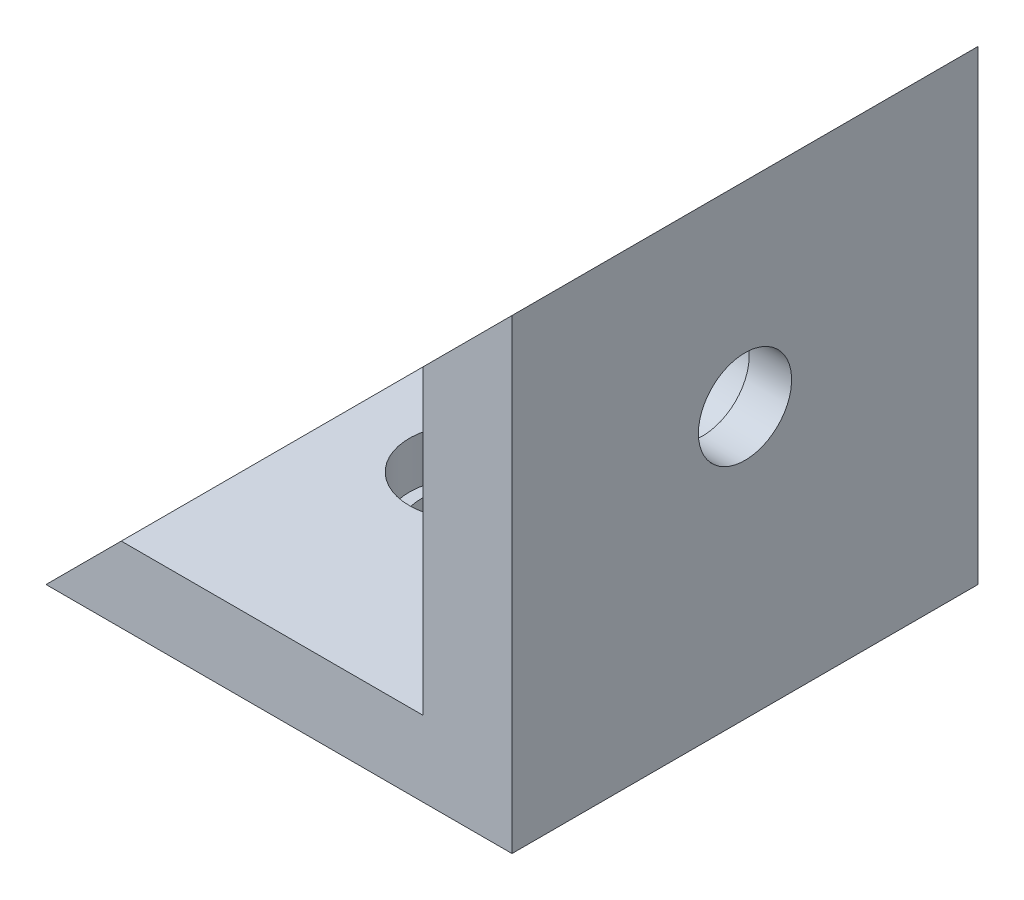
ISO-10303-21;
HEADER;
FILE_DESCRIPTION(('STEP AP214'),'2;1');
FILE_NAME('part.step','',(''),(''),'','','');
FILE_SCHEMA(('AUTOMOTIVE_DESIGN { 1 0 10303 214 1 1 1 1 }'));
ENDSEC;
DATA;
#1=APPLICATION_CONTEXT('core data for automotive mechanical design processes');
#2=APPLICATION_PROTOCOL_DEFINITION('international standard','automotive_design',2000,#1);
#3=PRODUCT_CONTEXT('',#1,'mechanical');
#4=PRODUCT('Part','Part','',(#3));
#5=PRODUCT_RELATED_PRODUCT_CATEGORY('part','',(#4));
#6=PRODUCT_DEFINITION_FORMATION('','',#4);
#7=PRODUCT_DEFINITION_CONTEXT('part definition',#1,'design');
#8=PRODUCT_DEFINITION('design','',#6,#7);
#9=PRODUCT_DEFINITION_SHAPE('','',#8);
#10=(LENGTH_UNIT() NAMED_UNIT(*) SI_UNIT(.MILLI.,.METRE.));
#11=(NAMED_UNIT(*) PLANE_ANGLE_UNIT() SI_UNIT($,.RADIAN.));
#12=(NAMED_UNIT(*) SI_UNIT($,.STERADIAN.) SOLID_ANGLE_UNIT());
#13=UNCERTAINTY_MEASURE_WITH_UNIT(LENGTH_MEASURE(1.E-05),#10,'distance_accuracy_value','');
#14=(GEOMETRIC_REPRESENTATION_CONTEXT(3) GLOBAL_UNCERTAINTY_ASSIGNED_CONTEXT((#13)) GLOBAL_UNIT_ASSIGNED_CONTEXT((#10,
#11,#12)) REPRESENTATION_CONTEXT('',''));
#15=CARTESIAN_POINT('',(0.,0.,0.));
#16=DIRECTION('',(0.,0.,1.));
#17=DIRECTION('',(1.,0.,0.));
#18=AXIS2_PLACEMENT_3D('',#15,#16,#17);
#19=CARTESIAN_POINT('',(-15.0810609763986,-22.3919909087651,10.));
#20=DIRECTION('',(0.,1.,0.));
#21=DIRECTION('',(0.,0.,1.));
#22=AXIS2_PLACEMENT_3D('',#19,#20,#21);
#23=CYLINDRICAL_SURFACE('',#22,2.);
#24=CARTESIAN_POINT('',(-15.0810609763986,-15.6220829740347,10.));
#25=DIRECTION('',(0.,1.,0.));
#26=DIRECTION('',(0.,0.,1.));
#27=AXIS2_PLACEMENT_3D('',#24,#25,#26);
#28=CIRCLE('',#27,2.);
#29=CARTESIAN_POINT('',(-15.0810609763986,-15.6220829740347,12.));
#30=VERTEX_POINT('',#29);
#31=EDGE_CURVE('E185',#30,#30,#28,.T.);
#32=ORIENTED_EDGE('',*,*,#31,.F.);
#33=EDGE_LOOP('',(#32));
#34=FACE_BOUND('',#33,.T.);
#35=CARTESIAN_POINT('',(-15.0810609763986,-14.3919909087651,10.));
#36=DIRECTION('',(0.,1.,0.));
#37=DIRECTION('',(0.,0.,1.));
#38=AXIS2_PLACEMENT_3D('',#35,#36,#37);
#39=CIRCLE('',#38,2.);
#40=CARTESIAN_POINT('',(-15.0810609763986,-14.3919909087651,12.));
#41=VERTEX_POINT('',#40);
#42=EDGE_CURVE('E51',#41,#41,#39,.F.);
#43=ORIENTED_EDGE('',*,*,#42,.F.);
#44=EDGE_LOOP('',(#43));
#45=FACE_BOUND('',#44,.T.);
#46=ADVANCED_FACE('F47',(#34,#45),#23,.F.);
#47=CARTESIAN_POINT('',(13.0106344586877,-4.00703694139992,10.));
#48=DIRECTION('',(-1.,0.,0.));
#49=DIRECTION('',(0.,0.,1.));
#50=AXIS2_PLACEMENT_3D('',#47,#48,#49);
#51=CYLINDRICAL_SURFACE('',#50,2.);
#52=CARTESIAN_POINT('',(-3.17275641148481,-4.00703694139992,10.));
#53=DIRECTION('',(-1.,0.,0.));
#54=DIRECTION('',(0.,0.,1.));
#55=AXIS2_PLACEMENT_3D('',#52,#53,#54);
#56=CIRCLE('',#55,2.);
#57=CARTESIAN_POINT('',(-3.17275641148481,-4.00703694139992,12.));
#58=VERTEX_POINT('',#57);
#59=EDGE_CURVE('E137',#58,#58,#56,.T.);
#60=ORIENTED_EDGE('',*,*,#59,.F.);
#61=EDGE_LOOP('',(#60));
#62=FACE_BOUND('',#61,.T.);
#63=CARTESIAN_POINT('',(-4.98936554131233,-4.00703694139992,10.));
#64=DIRECTION('',(-1.,0.,0.));
#65=DIRECTION('',(0.,0.,1.));
#66=AXIS2_PLACEMENT_3D('',#63,#64,#65);
#67=CIRCLE('',#66,2.);
#68=CARTESIAN_POINT('',(-4.98936554131233,-4.00703694139992,12.));
#69=VERTEX_POINT('',#68);
#70=EDGE_CURVE('E169',#69,#69,#67,.F.);
#71=ORIENTED_EDGE('',*,*,#70,.F.);
#72=EDGE_LOOP('',(#71));
#73=FACE_BOUND('',#72,.T.);
#74=ADVANCED_FACE('F206',(#62,#73),#51,.F.);
#75=CARTESIAN_POINT('',(-3.17275641148481,4.37791702596532,0.));
#76=DIRECTION('',(0.707106781186548,-0.707106781186548,0.));
#77=DIRECTION('',(0.707106781186548,0.707106781186548,0.));
#78=AXIS2_PLACEMENT_3D('',#75,#76,#77);
#79=PLANE('',#78);
#80=DIRECTION('',(0.,0.,1.));
#81=VECTOR('',#80,1.);
#82=CARTESIAN_POINT('',(-19.9426643462153,-12.3919909087651,0.));
#83=LINE('',#82,#81);
#84=CARTESIAN_POINT('',(-19.9426643462153,-12.3919909087651,0.));
#85=VERTEX_POINT('',#84);
#86=CARTESIAN_POINT('',(-19.9426643462153,-12.3919909087651,20.));
#87=VERTEX_POINT('',#86);
#88=EDGE_CURVE('E57',#85,#87,#83,.T.);
#89=ORIENTED_EDGE('',*,*,#88,.F.);
#90=DIRECTION('',(0.707106781186548,0.707106781186548,0.));
#91=VECTOR('',#90,1.);
#92=CARTESIAN_POINT('',(-3.17275641148481,4.37791702596532,0.));
#93=LINE('',#92,#91);
#94=CARTESIAN_POINT('',(-23.1727564114848,-15.6220829740347,0.));
#95=VERTEX_POINT('',#94);
#96=EDGE_CURVE('E95',#95,#85,#93,.T.);
#97=ORIENTED_EDGE('',*,*,#96,.F.);
#98=DIRECTION('',(0.,0.,-1.));
#99=VECTOR('',#98,1.);
#100=CARTESIAN_POINT('',(-23.1727564114848,-15.6220829740347,20.));
#101=LINE('',#100,#99);
#102=CARTESIAN_POINT('',(-23.1727564114848,-15.6220829740347,20.));
#103=VERTEX_POINT('',#102);
#104=EDGE_CURVE('E103',#103,#95,#101,.T.);
#105=ORIENTED_EDGE('',*,*,#104,.F.);
#106=DIRECTION('',(0.707106781186548,0.707106781186548,0.));
#107=VECTOR('',#106,1.);
#108=CARTESIAN_POINT('',(-3.17275641148481,4.37791702596532,20.));
#109=LINE('',#108,#107);
#110=EDGE_CURVE('E145',#103,#87,#109,.T.);
#111=ORIENTED_EDGE('',*,*,#110,.T.);
#112=EDGE_LOOP('',(#89,#97,#105,#111));
#113=FACE_BOUND('',#112,.T.);
#114=ADVANCED_FACE('F214',(#113),#79,.F.);
#115=CARTESIAN_POINT('',(-23.1727564114848,-15.6220829740347,20.));
#116=DIRECTION('',(0.,1.,0.));
#117=DIRECTION('',(0.,0.,1.));
#118=AXIS2_PLACEMENT_3D('',#115,#116,#117);
#119=PLANE('',#118);
#120=ORIENTED_EDGE('',*,*,#31,.T.);
#121=EDGE_LOOP('',(#120));
#122=FACE_BOUND('',#121,.T.);
#123=DIRECTION('',(1.,0.,0.));
#124=VECTOR('',#123,1.);
#125=CARTESIAN_POINT('',(-23.1727564114848,-15.6220829740347,0.));
#126=LINE('',#125,#124);
#127=CARTESIAN_POINT('',(-3.17275641148481,-15.6220829740347,0.));
#128=VERTEX_POINT('',#127);
#129=EDGE_CURVE('E151',#95,#128,#126,.T.);
#130=ORIENTED_EDGE('',*,*,#129,.T.);
#131=DIRECTION('',(0.,0.,-1.));
#132=VECTOR('',#131,1.);
#133=CARTESIAN_POINT('',(-3.17275641148481,-15.6220829740347,20.));
#134=LINE('',#133,#132);
#135=CARTESIAN_POINT('',(-3.17275641148481,-15.6220829740347,20.));
#136=VERTEX_POINT('',#135);
#137=EDGE_CURVE('E162',#136,#128,#134,.T.);
#138=ORIENTED_EDGE('',*,*,#137,.F.);
#139=DIRECTION('',(1.,0.,0.));
#140=VECTOR('',#139,1.);
#141=CARTESIAN_POINT('',(-23.1727564114848,-15.6220829740347,20.));
#142=LINE('',#141,#140);
#143=EDGE_CURVE('E74',#103,#136,#142,.T.);
#144=ORIENTED_EDGE('',*,*,#143,.F.);
#145=ORIENTED_EDGE('',*,*,#104,.T.);
#146=EDGE_LOOP('',(#130,#138,#144,#145));
#147=FACE_BOUND('',#146,.T.);
#148=ADVANCED_FACE('F242',(#122,#147),#119,.F.);
#149=CARTESIAN_POINT('',(-3.17275641148481,-15.6220829740347,20.));
#150=DIRECTION('',(-1.,0.,0.));
#151=DIRECTION('',(0.,0.,1.));
#152=AXIS2_PLACEMENT_3D('',#149,#150,#151);
#153=PLANE('',#152);
#154=ORIENTED_EDGE('',*,*,#59,.T.);
#155=EDGE_LOOP('',(#154));
#156=FACE_BOUND('',#155,.T.);
#157=DIRECTION('',(0.,1.,0.));
#158=VECTOR('',#157,1.);
#159=CARTESIAN_POINT('',(-3.17275641148481,-15.6220829740347,0.));
#160=LINE('',#159,#158);
#161=CARTESIAN_POINT('',(-3.17275641148481,4.37791702596532,0.));
#162=VERTEX_POINT('',#161);
#163=EDGE_CURVE('E144',#128,#162,#160,.T.);
#164=ORIENTED_EDGE('',*,*,#163,.T.);
#165=DIRECTION('',(0.,0.,-1.));
#166=VECTOR('',#165,1.);
#167=CARTESIAN_POINT('',(-3.17275641148481,4.37791702596532,20.));
#168=LINE('',#167,#166);
#169=CARTESIAN_POINT('',(-3.17275641148481,4.37791702596532,20.));
#170=VERTEX_POINT('',#169);
#171=EDGE_CURVE('E154',#170,#162,#168,.T.);
#172=ORIENTED_EDGE('',*,*,#171,.F.);
#173=DIRECTION('',(0.,1.,0.));
#174=VECTOR('',#173,1.);
#175=CARTESIAN_POINT('',(-3.17275641148481,-15.6220829740347,20.));
#176=LINE('',#175,#174);
#177=EDGE_CURVE('E148',#136,#170,#176,.T.);
#178=ORIENTED_EDGE('',*,*,#177,.F.);
#179=ORIENTED_EDGE('',*,*,#137,.T.);
#180=EDGE_LOOP('',(#164,#172,#178,#179));
#181=FACE_BOUND('',#180,.T.);
#182=ADVANCED_FACE('F49',(#156,#181),#153,.F.);
#183=CARTESIAN_POINT('',(0.,0.,20.));
#184=DIRECTION('',(0.,0.,1.));
#185=DIRECTION('',(1.,0.,0.));
#186=AXIS2_PLACEMENT_3D('',#183,#184,#185);
#187=PLANE('',#186);
#188=DIRECTION('',(0.,1.,0.));
#189=VECTOR('',#188,1.);
#190=CARTESIAN_POINT('',(-6.98936554131233,-12.3919909087651,20.));
#191=LINE('',#190,#189);
#192=CARTESIAN_POINT('',(-6.98936554131233,-12.3919909087651,20.));
#193=VERTEX_POINT('',#192);
#194=CARTESIAN_POINT('',(-6.98936554131233,0.561307896137794,20.));
#195=VERTEX_POINT('',#194);
#196=EDGE_CURVE('E112',#193,#195,#191,.T.);
#197=ORIENTED_EDGE('',*,*,#196,.F.);
#198=DIRECTION('',(-1.,0.,0.));
#199=VECTOR('',#198,1.);
#200=CARTESIAN_POINT('',(-6.98936554131233,-12.3919909087651,20.));
#201=LINE('',#200,#199);
#202=EDGE_CURVE('E122',#193,#87,#201,.T.);
#203=ORIENTED_EDGE('',*,*,#202,.T.);
#204=ORIENTED_EDGE('',*,*,#110,.F.);
#205=ORIENTED_EDGE('',*,*,#143,.T.);
#206=ORIENTED_EDGE('',*,*,#177,.T.);
#207=EDGE_CURVE('E124',#195,#170,#109,.T.);
#208=ORIENTED_EDGE('',*,*,#207,.F.);
#209=EDGE_LOOP('',(#197,#203,#204,#205,#206,#208));
#210=FACE_BOUND('',#209,.T.);
#211=ADVANCED_FACE('F238',(#210),#187,.T.);
#212=CARTESIAN_POINT('',(0.,0.,0.));
#213=DIRECTION('',(0.,0.,1.));
#214=DIRECTION('',(1.,0.,0.));
#215=AXIS2_PLACEMENT_3D('',#212,#213,#214);
#216=PLANE('',#215);
#217=DIRECTION('',(-1.,0.,0.));
#218=VECTOR('',#217,1.);
#219=CARTESIAN_POINT('',(-6.98936554131233,-12.3919909087651,0.));
#220=LINE('',#219,#218);
#221=CARTESIAN_POINT('',(-6.98936554131233,-12.3919909087651,0.));
#222=VERTEX_POINT('',#221);
#223=EDGE_CURVE('E65',#222,#85,#220,.T.);
#224=ORIENTED_EDGE('',*,*,#223,.F.);
#225=DIRECTION('',(0.,1.,0.));
#226=VECTOR('',#225,1.);
#227=CARTESIAN_POINT('',(-6.98936554131233,-12.3919909087651,0.));
#228=LINE('',#227,#226);
#229=CARTESIAN_POINT('',(-6.98936554131233,0.561307896137794,0.));
#230=VERTEX_POINT('',#229);
#231=EDGE_CURVE('E125',#222,#230,#228,.T.);
#232=ORIENTED_EDGE('',*,*,#231,.T.);
#233=EDGE_CURVE('E88',#230,#162,#93,.T.);
#234=ORIENTED_EDGE('',*,*,#233,.T.);
#235=ORIENTED_EDGE('',*,*,#163,.F.);
#236=ORIENTED_EDGE('',*,*,#129,.F.);
#237=ORIENTED_EDGE('',*,*,#96,.T.);
#238=EDGE_LOOP('',(#224,#232,#234,#235,#236,#237));
#239=FACE_BOUND('',#238,.T.);
#240=ADVANCED_FACE('F130',(#239),#216,.F.);
#241=ORIENTED_EDGE('',*,*,#233,.F.);
#242=DIRECTION('',(0.,0.,1.));
#243=VECTOR('',#242,1.);
#244=CARTESIAN_POINT('',(-6.98936554131233,0.561307896137799,0.));
#245=LINE('',#244,#243);
#246=EDGE_CURVE('E11',#230,#195,#245,.T.);
#247=ORIENTED_EDGE('',*,*,#246,.T.);
#248=ORIENTED_EDGE('',*,*,#207,.T.);
#249=ORIENTED_EDGE('',*,*,#171,.T.);
#250=EDGE_LOOP('',(#241,#247,#248,#249));
#251=FACE_BOUND('',#250,.T.);
#252=ADVANCED_FACE('F231',(#251),#79,.F.);
#253=CARTESIAN_POINT('',(-6.98936554131233,-12.3919909087651,0.));
#254=DIRECTION('',(1.,0.,0.));
#255=DIRECTION('',(0.,0.,-1.));
#256=AXIS2_PLACEMENT_3D('',#253,#254,#255);
#257=PLANE('',#256);
#258=CARTESIAN_POINT('',(-6.98936554131233,-4.00703694139992,10.));
#259=DIRECTION('',(-1.,0.,0.));
#260=DIRECTION('',(0.,0.,1.));
#261=AXIS2_PLACEMENT_3D('',#258,#259,#260);
#262=CIRCLE('',#261,2.5);
#263=CARTESIAN_POINT('',(-6.98936554131233,-4.00703694139992,12.5));
#264=VERTEX_POINT('',#263);
#265=EDGE_CURVE('E179',#264,#264,#262,.T.);
#266=ORIENTED_EDGE('',*,*,#265,.F.);
#267=EDGE_LOOP('',(#266));
#268=FACE_BOUND('',#267,.T.);
#269=ORIENTED_EDGE('',*,*,#231,.F.);
#270=DIRECTION('',(0.,0.,1.));
#271=VECTOR('',#270,1.);
#272=CARTESIAN_POINT('',(-6.98936554131233,-12.3919909087651,0.));
#273=LINE('',#272,#271);
#274=EDGE_CURVE('E119',#222,#193,#273,.T.);
#275=ORIENTED_EDGE('',*,*,#274,.T.);
#276=ORIENTED_EDGE('',*,*,#196,.T.);
#277=ORIENTED_EDGE('',*,*,#246,.F.);
#278=EDGE_LOOP('',(#269,#275,#276,#277));
#279=FACE_BOUND('',#278,.T.);
#280=ADVANCED_FACE('F127',(#268,#279),#257,.F.);
#281=CARTESIAN_POINT('',(-6.98936554131233,-12.3919909087651,0.));
#282=DIRECTION('',(0.,1.,0.));
#283=DIRECTION('',(0.,0.,1.));
#284=AXIS2_PLACEMENT_3D('',#281,#282,#283);
#285=PLANE('',#284);
#286=CARTESIAN_POINT('',(-15.0810609763986,-12.3919909087651,10.));
#287=DIRECTION('',(0.,1.,0.));
#288=DIRECTION('',(0.,0.,1.));
#289=AXIS2_PLACEMENT_3D('',#286,#287,#288);
#290=CIRCLE('',#289,2.5);
#291=CARTESIAN_POINT('',(-15.0810609763986,-12.3919909087651,12.5));
#292=VERTEX_POINT('',#291);
#293=EDGE_CURVE('E190',#292,#292,#290,.T.);
#294=ORIENTED_EDGE('',*,*,#293,.F.);
#295=EDGE_LOOP('',(#294));
#296=FACE_BOUND('',#295,.T.);
#297=ORIENTED_EDGE('',*,*,#88,.T.);
#298=ORIENTED_EDGE('',*,*,#202,.F.);
#299=ORIENTED_EDGE('',*,*,#274,.F.);
#300=ORIENTED_EDGE('',*,*,#223,.T.);
#301=EDGE_LOOP('',(#297,#298,#299,#300));
#302=FACE_BOUND('',#301,.T.);
#303=ADVANCED_FACE('F120',(#296,#302),#285,.T.);
#304=CARTESIAN_POINT('',(-4.98936554131233,-4.00703694139992,10.));
#305=DIRECTION('',(-1.,0.,0.));
#306=DIRECTION('',(0.,0.,1.));
#307=AXIS2_PLACEMENT_3D('',#304,#305,#306);
#308=PLANE('',#307);
#309=CARTESIAN_POINT('',(-4.98936554131233,-4.00703694139992,10.));
#310=DIRECTION('',(-1.,0.,0.));
#311=DIRECTION('',(0.,0.,1.));
#312=AXIS2_PLACEMENT_3D('',#309,#310,#311);
#313=CIRCLE('',#312,2.5);
#314=CARTESIAN_POINT('',(-4.98936554131233,-4.00703694139992,12.5));
#315=VERTEX_POINT('',#314);
#316=EDGE_CURVE('E172',#315,#315,#313,.T.);
#317=ORIENTED_EDGE('',*,*,#316,.T.);
#318=EDGE_LOOP('',(#317));
#319=FACE_BOUND('',#318,.T.);
#320=ORIENTED_EDGE('',*,*,#70,.T.);
#321=EDGE_LOOP('',(#320));
#322=FACE_BOUND('',#321,.T.);
#323=ADVANCED_FACE('F222',(#319,#322),#308,.T.);
#324=CARTESIAN_POINT('',(-4.98936554131233,-4.00703694139992,10.));
#325=DIRECTION('',(-1.,0.,0.));
#326=DIRECTION('',(0.,0.,1.));
#327=AXIS2_PLACEMENT_3D('',#324,#325,#326);
#328=CYLINDRICAL_SURFACE('',#327,2.5);
#329=ORIENTED_EDGE('',*,*,#316,.F.);
#330=EDGE_LOOP('',(#329));
#331=FACE_BOUND('',#330,.T.);
#332=ORIENTED_EDGE('',*,*,#265,.T.);
#333=EDGE_LOOP('',(#332));
#334=FACE_BOUND('',#333,.T.);
#335=ADVANCED_FACE('F225',(#331,#334),#328,.F.);
#336=CARTESIAN_POINT('',(-15.0810609763986,-14.3919909087651,10.));
#337=DIRECTION('',(0.,1.,0.));
#338=DIRECTION('',(0.,0.,1.));
#339=AXIS2_PLACEMENT_3D('',#336,#337,#338);
#340=PLANE('',#339);
#341=CARTESIAN_POINT('',(-15.0810609763986,-14.3919909087651,10.));
#342=DIRECTION('',(0.,1.,0.));
#343=DIRECTION('',(0.,0.,1.));
#344=AXIS2_PLACEMENT_3D('',#341,#342,#343);
#345=CIRCLE('',#344,2.5);
#346=CARTESIAN_POINT('',(-15.0810609763986,-14.3919909087651,12.5));
#347=VERTEX_POINT('',#346);
#348=EDGE_CURVE('E194',#347,#347,#345,.T.);
#349=ORIENTED_EDGE('',*,*,#348,.T.);
#350=EDGE_LOOP('',(#349));
#351=FACE_BOUND('',#350,.T.);
#352=ORIENTED_EDGE('',*,*,#42,.T.);
#353=EDGE_LOOP('',(#352));
#354=FACE_BOUND('',#353,.T.);
#355=ADVANCED_FACE('F203',(#351,#354),#340,.T.);
#356=CARTESIAN_POINT('',(-15.0810609763986,-14.3919909087651,10.));
#357=DIRECTION('',(0.,1.,0.));
#358=DIRECTION('',(0.,0.,1.));
#359=AXIS2_PLACEMENT_3D('',#356,#357,#358);
#360=CYLINDRICAL_SURFACE('',#359,2.5);
#361=ORIENTED_EDGE('',*,*,#348,.F.);
#362=EDGE_LOOP('',(#361));
#363=FACE_BOUND('',#362,.T.);
#364=ORIENTED_EDGE('',*,*,#293,.T.);
#365=EDGE_LOOP('',(#364));
#366=FACE_BOUND('',#365,.T.);
#367=ADVANCED_FACE('F220',(#363,#366),#360,.F.);
#368=CLOSED_SHELL('',(#46,#74,#114,#148,#182,#211,#240,#252,#280,#303,#323,#335,#355,#367));
#369=MANIFOLD_SOLID_BREP('B2',#368);
#370=ADVANCED_BREP_SHAPE_REPRESENTATION('',(#18,#369),#14);
#371=SHAPE_DEFINITION_REPRESENTATION(#9,#370);
ENDSEC;
END-ISO-10303-21;
